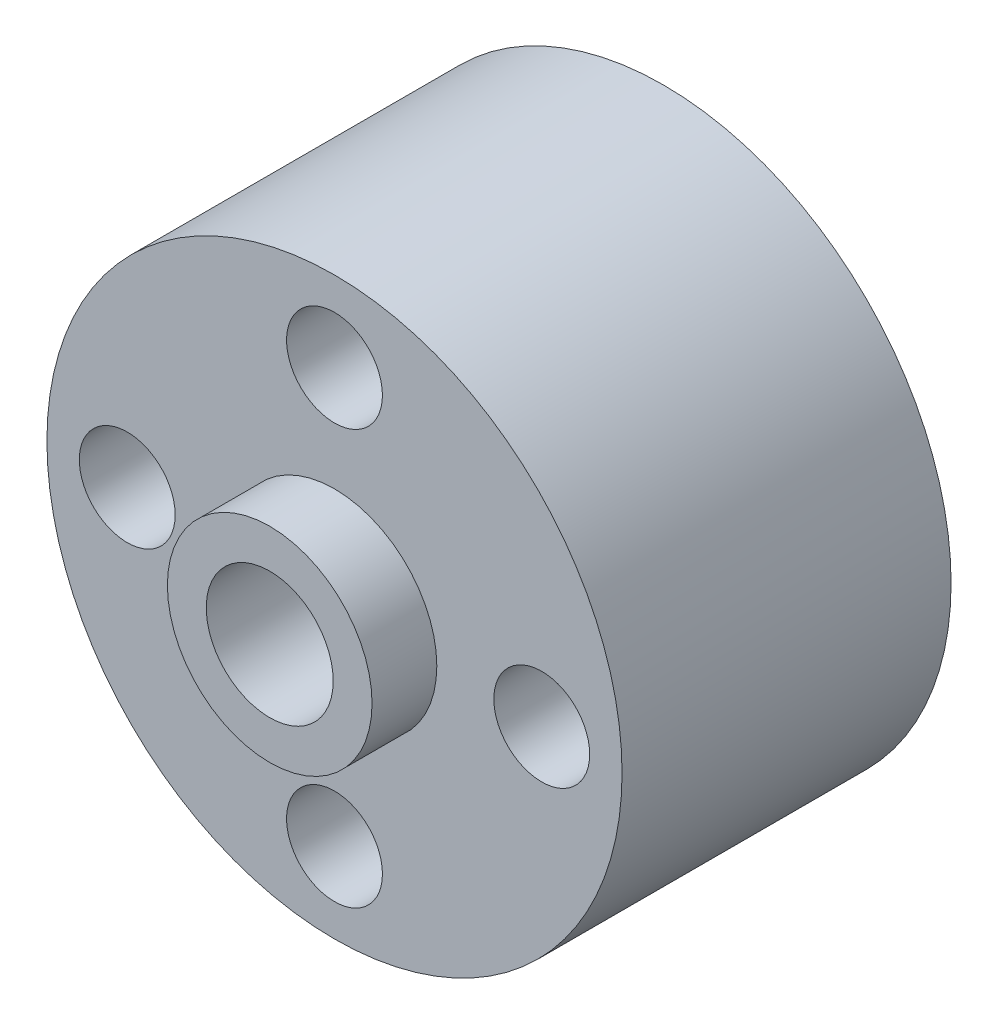
ISO-10303-21;
HEADER;
FILE_DESCRIPTION(('STEP AP214'),'2;1');
FILE_NAME('part.step','',(''),(''),'','','');
FILE_SCHEMA(('AUTOMOTIVE_DESIGN { 1 0 10303 214 1 1 1 1 }'));
ENDSEC;
DATA;
#1=APPLICATION_CONTEXT('core data for automotive mechanical design processes');
#2=APPLICATION_PROTOCOL_DEFINITION('international standard','automotive_design',2000,#1);
#3=PRODUCT_CONTEXT('',#1,'mechanical');
#4=PRODUCT('Part','Part','',(#3));
#5=PRODUCT_RELATED_PRODUCT_CATEGORY('part','',(#4));
#6=PRODUCT_DEFINITION_FORMATION('','',#4);
#7=PRODUCT_DEFINITION_CONTEXT('part definition',#1,'design');
#8=PRODUCT_DEFINITION('design','',#6,#7);
#9=PRODUCT_DEFINITION_SHAPE('','',#8);
#10=(LENGTH_UNIT() NAMED_UNIT(*) SI_UNIT(.MILLI.,.METRE.));
#11=(NAMED_UNIT(*) PLANE_ANGLE_UNIT() SI_UNIT($,.RADIAN.));
#12=(NAMED_UNIT(*) SI_UNIT($,.STERADIAN.) SOLID_ANGLE_UNIT());
#13=UNCERTAINTY_MEASURE_WITH_UNIT(LENGTH_MEASURE(1.E-05),#10,'distance_accuracy_value','');
#14=(GEOMETRIC_REPRESENTATION_CONTEXT(3) GLOBAL_UNCERTAINTY_ASSIGNED_CONTEXT((#13)) GLOBAL_UNIT_ASSIGNED_CONTEXT((#10,
#11,#12)) REPRESENTATION_CONTEXT('',''));
#15=CARTESIAN_POINT('',(0.,0.,0.));
#16=DIRECTION('',(0.,0.,1.));
#17=DIRECTION('',(1.,0.,0.));
#18=AXIS2_PLACEMENT_3D('',#15,#16,#17);
#19=CARTESIAN_POINT('',(-10.7279618479197,0.728592205462064,-3.68399553764684));
#20=DIRECTION('',(0.,0.,1.));
#21=DIRECTION('',(1.,0.,0.));
#22=AXIS2_PLACEMENT_3D('',#19,#20,#21);
#23=CYLINDRICAL_SURFACE('',#22,2.45);
#24=CARTESIAN_POINT('',(-10.7279618479197,0.728592205462064,14.0160044623532));
#25=DIRECTION('',(0.,0.,1.));
#26=DIRECTION('',(1.,0.,0.));
#27=AXIS2_PLACEMENT_3D('',#24,#25,#26);
#28=CIRCLE('',#27,2.45);
#29=CARTESIAN_POINT('',(-8.27796184791969,0.728592205462064,14.0160044623532));
#30=VERTEX_POINT('',#29);
#31=EDGE_CURVE('E64',#30,#30,#28,.F.);
#32=ORIENTED_EDGE('',*,*,#31,.F.);
#33=EDGE_LOOP('',(#32));
#34=FACE_BOUND('',#33,.T.);
#35=CARTESIAN_POINT('',(-10.7279618479197,0.728592205462064,-3.68399553764684));
#36=DIRECTION('',(0.,0.,1.));
#37=DIRECTION('',(1.,0.,0.));
#38=AXIS2_PLACEMENT_3D('',#35,#36,#37);
#39=CIRCLE('',#38,2.45);
#40=CARTESIAN_POINT('',(-8.27796184791969,0.728592205462064,-3.68399553764684));
#41=VERTEX_POINT('',#40);
#42=EDGE_CURVE('E18',#41,#41,#39,.T.);
#43=ORIENTED_EDGE('',*,*,#42,.F.);
#44=EDGE_LOOP('',(#43));
#45=FACE_BOUND('',#44,.T.);
#46=ADVANCED_FACE('F15',(#34,#45),#23,.F.);
#47=CARTESIAN_POINT('',(-10.7279618479197,0.728592205462064,-3.68399553764684));
#48=DIRECTION('',(0.,0.,-1.));
#49=DIRECTION('',(-1.,0.,0.));
#50=AXIS2_PLACEMENT_3D('',#47,#48,#49);
#51=PLANE('',#50);
#52=CARTESIAN_POINT('',(-10.7279618479197,0.728592205462064,-3.68399553764684));
#53=DIRECTION('',(0.,0.,1.));
#54=DIRECTION('',(1.,0.,0.));
#55=AXIS2_PLACEMENT_3D('',#52,#53,#54);
#56=CIRCLE('',#55,3.95);
#57=CARTESIAN_POINT('',(-6.77796184791969,0.728592205462064,-3.68399553764684));
#58=VERTEX_POINT('',#57);
#59=EDGE_CURVE('E62',#58,#58,#56,.T.);
#60=ORIENTED_EDGE('',*,*,#59,.F.);
#61=EDGE_LOOP('',(#60));
#62=FACE_BOUND('',#61,.T.);
#63=ORIENTED_EDGE('',*,*,#42,.T.);
#64=EDGE_LOOP('',(#63));
#65=FACE_BOUND('',#64,.T.);
#66=ADVANCED_FACE('F71',(#62,#65),#51,.T.);
#67=CARTESIAN_POINT('',(-10.7279618479197,0.728592205462064,14.0160044623532));
#68=DIRECTION('',(0.,0.,1.));
#69=DIRECTION('',(1.,0.,0.));
#70=AXIS2_PLACEMENT_3D('',#67,#68,#69);
#71=PLANE('',#70);
#72=CARTESIAN_POINT('',(-10.7279618479197,0.728592205462064,14.0160044623532));
#73=DIRECTION('',(0.,0.,-1.));
#74=DIRECTION('',(-1.,0.,0.));
#75=AXIS2_PLACEMENT_3D('',#72,#73,#74);
#76=CIRCLE('',#75,3.95);
#77=CARTESIAN_POINT('',(-14.6779618479197,0.728592205462064,14.0160044623532));
#78=VERTEX_POINT('',#77);
#79=EDGE_CURVE('E59',#78,#78,#76,.T.);
#80=ORIENTED_EDGE('',*,*,#79,.F.);
#81=EDGE_LOOP('',(#80));
#82=FACE_BOUND('',#81,.T.);
#83=ORIENTED_EDGE('',*,*,#31,.T.);
#84=EDGE_LOOP('',(#83));
#85=FACE_BOUND('',#84,.T.);
#86=ADVANCED_FACE('F78',(#82,#85),#71,.T.);
#87=CARTESIAN_POINT('',(-10.7279618479197,0.728592205462064,-3.68399553764684));
#88=DIRECTION('',(0.,0.,1.));
#89=DIRECTION('',(1.,0.,0.));
#90=AXIS2_PLACEMENT_3D('',#87,#88,#89);
#91=CYLINDRICAL_SURFACE('',#90,3.95);
#92=ORIENTED_EDGE('',*,*,#59,.T.);
#93=EDGE_LOOP('',(#92));
#94=FACE_BOUND('',#93,.T.);
#95=CARTESIAN_POINT('',(-10.7279618479197,0.728592205462064,-1.18399553764684));
#96=DIRECTION('',(0.,0.,1.));
#97=DIRECTION('',(1.,0.,0.));
#98=AXIS2_PLACEMENT_3D('',#95,#96,#97);
#99=CIRCLE('',#98,3.95);
#100=CARTESIAN_POINT('',(-6.77796184791969,0.728592205462064,-1.18399553764684));
#101=VERTEX_POINT('',#100);
#102=EDGE_CURVE('E44',#101,#101,#99,.F.);
#103=ORIENTED_EDGE('',*,*,#102,.T.);
#104=EDGE_LOOP('',(#103));
#105=FACE_BOUND('',#104,.T.);
#106=ADVANCED_FACE('F114',(#94,#105),#91,.T.);
#107=CARTESIAN_POINT('',(-2.72796184791969,0.728592205462064,-1.18399553764684));
#108=DIRECTION('',(0.,0.,1.));
#109=DIRECTION('',(1.,0.,0.));
#110=AXIS2_PLACEMENT_3D('',#107,#108,#109);
#111=CYLINDRICAL_SURFACE('',#110,1.85);
#112=CARTESIAN_POINT('',(-2.72796184791969,0.728592205462064,11.5160044623532));
#113=DIRECTION('',(0.,0.,1.));
#114=DIRECTION('',(1.,0.,0.));
#115=AXIS2_PLACEMENT_3D('',#112,#113,#114);
#116=CIRCLE('',#115,1.85);
#117=CARTESIAN_POINT('',(-0.87796184791969,0.728592205462064,11.5160044623532));
#118=VERTEX_POINT('',#117);
#119=EDGE_CURVE('E41',#118,#118,#116,.F.);
#120=ORIENTED_EDGE('',*,*,#119,.F.);
#121=EDGE_LOOP('',(#120));
#122=FACE_BOUND('',#121,.T.);
#123=CARTESIAN_POINT('',(-2.72796184791969,0.728592205462064,-1.18399553764684));
#124=DIRECTION('',(0.,0.,1.));
#125=DIRECTION('',(1.,0.,0.));
#126=AXIS2_PLACEMENT_3D('',#123,#124,#125);
#127=CIRCLE('',#126,1.85);
#128=CARTESIAN_POINT('',(-0.87796184791969,0.728592205462064,-1.18399553764684));
#129=VERTEX_POINT('',#128);
#130=EDGE_CURVE('E56',#129,#129,#127,.F.);
#131=ORIENTED_EDGE('',*,*,#130,.T.);
#132=EDGE_LOOP('',(#131));
#133=FACE_BOUND('',#132,.T.);
#134=ADVANCED_FACE('F110',(#122,#133),#111,.F.);
#135=CARTESIAN_POINT('',(-18.7279618479197,0.728592205462064,-1.18399553764684));
#136=DIRECTION('',(0.,0.,1.));
#137=DIRECTION('',(1.,0.,0.));
#138=AXIS2_PLACEMENT_3D('',#135,#136,#137);
#139=CYLINDRICAL_SURFACE('',#138,1.85);
#140=CARTESIAN_POINT('',(-18.7279618479197,0.728592205462064,11.5160044623532));
#141=DIRECTION('',(0.,0.,1.));
#142=DIRECTION('',(1.,0.,0.));
#143=AXIS2_PLACEMENT_3D('',#140,#141,#142);
#144=CIRCLE('',#143,1.85);
#145=CARTESIAN_POINT('',(-16.8779618479197,0.728592205462064,11.5160044623532));
#146=VERTEX_POINT('',#145);
#147=EDGE_CURVE('E38',#146,#146,#144,.F.);
#148=ORIENTED_EDGE('',*,*,#147,.F.);
#149=EDGE_LOOP('',(#148));
#150=FACE_BOUND('',#149,.T.);
#151=CARTESIAN_POINT('',(-18.7279618479197,0.728592205462064,-1.18399553764684));
#152=DIRECTION('',(0.,0.,1.));
#153=DIRECTION('',(1.,0.,0.));
#154=AXIS2_PLACEMENT_3D('',#151,#152,#153);
#155=CIRCLE('',#154,1.85);
#156=CARTESIAN_POINT('',(-16.8779618479197,0.728592205462064,-1.18399553764684));
#157=VERTEX_POINT('',#156);
#158=EDGE_CURVE('E53',#157,#157,#155,.F.);
#159=ORIENTED_EDGE('',*,*,#158,.T.);
#160=EDGE_LOOP('',(#159));
#161=FACE_BOUND('',#160,.T.);
#162=ADVANCED_FACE('F106',(#150,#161),#139,.F.);
#163=CARTESIAN_POINT('',(-10.7279618479197,-7.27140779453794,-1.18399553764684));
#164=DIRECTION('',(0.,0.,1.));
#165=DIRECTION('',(1.,0.,0.));
#166=AXIS2_PLACEMENT_3D('',#163,#164,#165);
#167=CYLINDRICAL_SURFACE('',#166,1.85);
#168=CARTESIAN_POINT('',(-10.7279618479197,-7.27140779453794,11.5160044623532));
#169=DIRECTION('',(0.,0.,1.));
#170=DIRECTION('',(1.,0.,0.));
#171=AXIS2_PLACEMENT_3D('',#168,#169,#170);
#172=CIRCLE('',#171,1.85);
#173=CARTESIAN_POINT('',(-8.87796184791969,-7.27140779453794,11.5160044623532));
#174=VERTEX_POINT('',#173);
#175=EDGE_CURVE('E35',#174,#174,#172,.F.);
#176=ORIENTED_EDGE('',*,*,#175,.F.);
#177=EDGE_LOOP('',(#176));
#178=FACE_BOUND('',#177,.T.);
#179=CARTESIAN_POINT('',(-10.7279618479197,-7.27140779453794,-1.18399553764684));
#180=DIRECTION('',(0.,0.,1.));
#181=DIRECTION('',(1.,0.,0.));
#182=AXIS2_PLACEMENT_3D('',#179,#180,#181);
#183=CIRCLE('',#182,1.85);
#184=CARTESIAN_POINT('',(-8.87796184791969,-7.27140779453794,-1.18399553764684));
#185=VERTEX_POINT('',#184);
#186=EDGE_CURVE('E50',#185,#185,#183,.F.);
#187=ORIENTED_EDGE('',*,*,#186,.T.);
#188=EDGE_LOOP('',(#187));
#189=FACE_BOUND('',#188,.T.);
#190=ADVANCED_FACE('F102',(#178,#189),#167,.F.);
#191=CARTESIAN_POINT('',(-10.7279618479197,8.72859220546206,-1.18399553764684));
#192=DIRECTION('',(0.,0.,1.));
#193=DIRECTION('',(1.,0.,0.));
#194=AXIS2_PLACEMENT_3D('',#191,#192,#193);
#195=CYLINDRICAL_SURFACE('',#194,1.85);
#196=CARTESIAN_POINT('',(-10.7279618479197,8.72859220546206,11.5160044623532));
#197=DIRECTION('',(0.,0.,1.));
#198=DIRECTION('',(1.,0.,0.));
#199=AXIS2_PLACEMENT_3D('',#196,#197,#198);
#200=CIRCLE('',#199,1.85);
#201=CARTESIAN_POINT('',(-8.87796184791969,8.72859220546206,11.5160044623532));
#202=VERTEX_POINT('',#201);
#203=EDGE_CURVE('E32',#202,#202,#200,.F.);
#204=ORIENTED_EDGE('',*,*,#203,.F.);
#205=EDGE_LOOP('',(#204));
#206=FACE_BOUND('',#205,.T.);
#207=CARTESIAN_POINT('',(-10.7279618479197,8.72859220546206,-1.18399553764684));
#208=DIRECTION('',(0.,0.,1.));
#209=DIRECTION('',(1.,0.,0.));
#210=AXIS2_PLACEMENT_3D('',#207,#208,#209);
#211=CIRCLE('',#210,1.85);
#212=CARTESIAN_POINT('',(-8.87796184791969,8.72859220546206,-1.18399553764684));
#213=VERTEX_POINT('',#212);
#214=EDGE_CURVE('E47',#213,#213,#211,.F.);
#215=ORIENTED_EDGE('',*,*,#214,.T.);
#216=EDGE_LOOP('',(#215));
#217=FACE_BOUND('',#216,.T.);
#218=ADVANCED_FACE('F98',(#206,#217),#195,.F.);
#219=CARTESIAN_POINT('',(-10.7279618479197,0.728592205462064,14.0160044623532));
#220=DIRECTION('',(0.,0.,-1.));
#221=DIRECTION('',(-1.,0.,0.));
#222=AXIS2_PLACEMENT_3D('',#219,#220,#221);
#223=CYLINDRICAL_SURFACE('',#222,3.95);
#224=CARTESIAN_POINT('',(-10.7279618479197,0.728592205462064,11.5160044623532));
#225=DIRECTION('',(0.,0.,-1.));
#226=DIRECTION('',(-1.,0.,0.));
#227=AXIS2_PLACEMENT_3D('',#224,#225,#226);
#228=CIRCLE('',#227,3.95);
#229=CARTESIAN_POINT('',(-14.6779618479197,0.728592205462064,11.5160044623532));
#230=VERTEX_POINT('',#229);
#231=EDGE_CURVE('E27',#230,#230,#228,.T.);
#232=ORIENTED_EDGE('',*,*,#231,.F.);
#233=EDGE_LOOP('',(#232));
#234=FACE_BOUND('',#233,.T.);
#235=ORIENTED_EDGE('',*,*,#79,.T.);
#236=EDGE_LOOP('',(#235));
#237=FACE_BOUND('',#236,.T.);
#238=ADVANCED_FACE('F94',(#234,#237),#223,.T.);
#239=CARTESIAN_POINT('',(-10.7279618479197,0.728592205462064,-1.18399553764684));
#240=DIRECTION('',(0.,0.,1.));
#241=DIRECTION('',(1.,0.,0.));
#242=AXIS2_PLACEMENT_3D('',#239,#240,#241);
#243=PLANE('',#242);
#244=ORIENTED_EDGE('',*,*,#102,.F.);
#245=EDGE_LOOP('',(#244));
#246=FACE_BOUND('',#245,.T.);
#247=ORIENTED_EDGE('',*,*,#214,.F.);
#248=EDGE_LOOP('',(#247));
#249=FACE_BOUND('',#248,.T.);
#250=ORIENTED_EDGE('',*,*,#186,.F.);
#251=EDGE_LOOP('',(#250));
#252=FACE_BOUND('',#251,.T.);
#253=ORIENTED_EDGE('',*,*,#158,.F.);
#254=EDGE_LOOP('',(#253));
#255=FACE_BOUND('',#254,.T.);
#256=ORIENTED_EDGE('',*,*,#130,.F.);
#257=EDGE_LOOP('',(#256));
#258=FACE_BOUND('',#257,.T.);
#259=CARTESIAN_POINT('',(-10.7279618479197,0.728592205462064,-1.18399553764684));
#260=DIRECTION('',(0.,0.,1.));
#261=DIRECTION('',(1.,0.,0.));
#262=AXIS2_PLACEMENT_3D('',#259,#260,#261);
#263=CIRCLE('',#262,11.1);
#264=CARTESIAN_POINT('',(0.372038152080313,0.728592205462064,-1.18399553764684));
#265=VERTEX_POINT('',#264);
#266=EDGE_CURVE('E22',#265,#265,#263,.T.);
#267=ORIENTED_EDGE('',*,*,#266,.F.);
#268=EDGE_LOOP('',(#267));
#269=FACE_BOUND('',#268,.T.);
#270=ADVANCED_FACE('F87',(#246,#249,#252,#255,#258,#269),#243,.F.);
#271=CARTESIAN_POINT('',(-10.7279618479197,0.728592205462064,11.5160044623532));
#272=DIRECTION('',(0.,0.,1.));
#273=DIRECTION('',(1.,0.,0.));
#274=AXIS2_PLACEMENT_3D('',#271,#272,#273);
#275=PLANE('',#274);
#276=ORIENTED_EDGE('',*,*,#231,.T.);
#277=EDGE_LOOP('',(#276));
#278=FACE_BOUND('',#277,.T.);
#279=ORIENTED_EDGE('',*,*,#203,.T.);
#280=EDGE_LOOP('',(#279));
#281=FACE_BOUND('',#280,.T.);
#282=ORIENTED_EDGE('',*,*,#175,.T.);
#283=EDGE_LOOP('',(#282));
#284=FACE_BOUND('',#283,.T.);
#285=ORIENTED_EDGE('',*,*,#147,.T.);
#286=EDGE_LOOP('',(#285));
#287=FACE_BOUND('',#286,.T.);
#288=ORIENTED_EDGE('',*,*,#119,.T.);
#289=EDGE_LOOP('',(#288));
#290=FACE_BOUND('',#289,.T.);
#291=CARTESIAN_POINT('',(-10.7279618479197,0.728592205462064,11.5160044623532));
#292=DIRECTION('',(0.,0.,1.));
#293=DIRECTION('',(1.,0.,0.));
#294=AXIS2_PLACEMENT_3D('',#291,#292,#293);
#295=CIRCLE('',#294,11.1);
#296=CARTESIAN_POINT('',(0.372038152080313,0.728592205462064,11.5160044623532));
#297=VERTEX_POINT('',#296);
#298=EDGE_CURVE('E9',#297,#297,#295,.F.);
#299=ORIENTED_EDGE('',*,*,#298,.F.);
#300=EDGE_LOOP('',(#299));
#301=FACE_BOUND('',#300,.T.);
#302=ADVANCED_FACE('F82',(#278,#281,#284,#287,#290,#301),#275,.T.);
#303=CARTESIAN_POINT('',(-10.7279618479197,0.728592205462064,-1.18399553764684));
#304=DIRECTION('',(0.,0.,1.));
#305=DIRECTION('',(1.,0.,0.));
#306=AXIS2_PLACEMENT_3D('',#303,#304,#305);
#307=CYLINDRICAL_SURFACE('',#306,11.1);
#308=ORIENTED_EDGE('',*,*,#298,.T.);
#309=EDGE_LOOP('',(#308));
#310=FACE_BOUND('',#309,.T.);
#311=ORIENTED_EDGE('',*,*,#266,.T.);
#312=EDGE_LOOP('',(#311));
#313=FACE_BOUND('',#312,.T.);
#314=ADVANCED_FACE('F80',(#310,#313),#307,.T.);
#315=CLOSED_SHELL('',(#46,#66,#86,#106,#134,#162,#190,#218,#238,#270,#302,#314));
#316=MANIFOLD_SOLID_BREP('B1',#315);
#317=ADVANCED_BREP_SHAPE_REPRESENTATION('',(#18,#316),#14);
#318=SHAPE_DEFINITION_REPRESENTATION(#9,#317);
ENDSEC;
END-ISO-10303-21;
